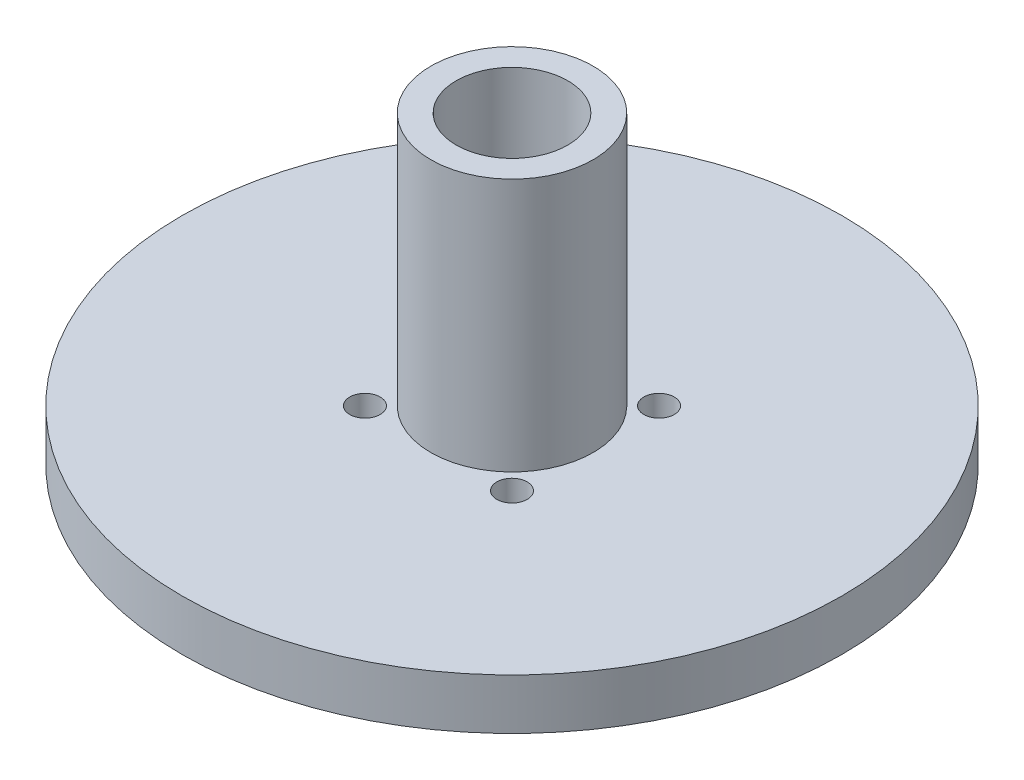
ISO-10303-21;
HEADER;
FILE_DESCRIPTION(('STEP AP214'),'2;1');
FILE_NAME('part.step','',(''),(''),'','','');
FILE_SCHEMA(('AUTOMOTIVE_DESIGN { 1 0 10303 214 1 1 1 1 }'));
ENDSEC;
DATA;
#1=APPLICATION_CONTEXT('core data for automotive mechanical design processes');
#2=APPLICATION_PROTOCOL_DEFINITION('international standard','automotive_design',2000,#1);
#3=PRODUCT_CONTEXT('',#1,'mechanical');
#4=PRODUCT('Part','Part','',(#3));
#5=PRODUCT_RELATED_PRODUCT_CATEGORY('part','',(#4));
#6=PRODUCT_DEFINITION_FORMATION('','',#4);
#7=PRODUCT_DEFINITION_CONTEXT('part definition',#1,'design');
#8=PRODUCT_DEFINITION('design','',#6,#7);
#9=PRODUCT_DEFINITION_SHAPE('','',#8);
#10=(LENGTH_UNIT() NAMED_UNIT(*) SI_UNIT(.MILLI.,.METRE.));
#11=(NAMED_UNIT(*) PLANE_ANGLE_UNIT() SI_UNIT($,.RADIAN.));
#12=(NAMED_UNIT(*) SI_UNIT($,.STERADIAN.) SOLID_ANGLE_UNIT());
#13=UNCERTAINTY_MEASURE_WITH_UNIT(LENGTH_MEASURE(1.E-05),#10,'distance_accuracy_value','');
#14=(GEOMETRIC_REPRESENTATION_CONTEXT(3) GLOBAL_UNCERTAINTY_ASSIGNED_CONTEXT((#13)) GLOBAL_UNIT_ASSIGNED_CONTEXT((#10,
#11,#12)) REPRESENTATION_CONTEXT('',''));
#15=CARTESIAN_POINT('',(0.,0.,0.));
#16=DIRECTION('',(0.,0.,1.));
#17=DIRECTION('',(1.,0.,0.));
#18=AXIS2_PLACEMENT_3D('',#15,#16,#17);
#19=CARTESIAN_POINT('',(0.,5.,0.));
#20=DIRECTION('',(0.,-1.,0.));
#21=DIRECTION('',(0.,0.,-1.));
#22=AXIS2_PLACEMENT_3D('',#19,#20,#21);
#23=CYLINDRICAL_SURFACE('',#22,32.5);
#24=CARTESIAN_POINT('',(0.,5.,0.));
#25=DIRECTION('',(0.,1.,0.));
#26=DIRECTION('',(0.,0.,1.));
#27=AXIS2_PLACEMENT_3D('',#24,#25,#26);
#28=CIRCLE('',#27,32.5);
#29=CARTESIAN_POINT('',(0.,5.,32.5));
#30=VERTEX_POINT('',#29);
#31=EDGE_CURVE('E51',#30,#30,#28,.T.);
#32=ORIENTED_EDGE('',*,*,#31,.F.);
#33=EDGE_LOOP('',(#32));
#34=FACE_BOUND('',#33,.T.);
#35=CARTESIAN_POINT('',(0.,0.,0.));
#36=DIRECTION('',(0.,1.,0.));
#37=DIRECTION('',(0.,0.,1.));
#38=AXIS2_PLACEMENT_3D('',#35,#36,#37);
#39=CIRCLE('',#38,32.5);
#40=CARTESIAN_POINT('',(0.,0.,32.5));
#41=VERTEX_POINT('',#40);
#42=EDGE_CURVE('E46',#41,#41,#39,.T.);
#43=ORIENTED_EDGE('',*,*,#42,.T.);
#44=EDGE_LOOP('',(#43));
#45=FACE_BOUND('',#44,.T.);
#46=ADVANCED_FACE('F43',(#34,#45),#23,.T.);
#47=CARTESIAN_POINT('',(0.,5.,0.));
#48=DIRECTION('',(0.,1.,0.));
#49=DIRECTION('',(0.,0.,1.));
#50=AXIS2_PLACEMENT_3D('',#47,#48,#49);
#51=PLANE('',#50);
#52=CARTESIAN_POINT('',(-7.24784450716205,5.,7.24784450716218));
#53=DIRECTION('',(0.,1.,0.));
#54=DIRECTION('',(0.,0.,1.));
#55=AXIS2_PLACEMENT_3D('',#52,#53,#54);
#56=CIRCLE('',#55,1.50000000000016);
#57=CARTESIAN_POINT('',(-7.24784450716205,5.,8.74784450716234));
#58=VERTEX_POINT('',#57);
#59=EDGE_CURVE('E58',#58,#58,#56,.F.);
#60=ORIENTED_EDGE('',*,*,#59,.T.);
#61=EDGE_LOOP('',(#60));
#62=FACE_BOUND('',#61,.T.);
#63=CARTESIAN_POINT('',(7.24784450716223,5.,7.24784450716209));
#64=DIRECTION('',(0.,1.,0.));
#65=DIRECTION('',(0.,0.,1.));
#66=AXIS2_PLACEMENT_3D('',#63,#64,#65);
#67=CIRCLE('',#66,1.50000000000016);
#68=CARTESIAN_POINT('',(7.24784450716223,5.,8.74784450716225));
#69=VERTEX_POINT('',#68);
#70=EDGE_CURVE('E62',#69,#69,#67,.F.);
#71=ORIENTED_EDGE('',*,*,#70,.T.);
#72=EDGE_LOOP('',(#71));
#73=FACE_BOUND('',#72,.T.);
#74=CARTESIAN_POINT('',(7.24784450716215,5.,-7.24784450716218));
#75=DIRECTION('',(0.,1.,0.));
#76=DIRECTION('',(0.,0.,1.));
#77=AXIS2_PLACEMENT_3D('',#74,#75,#76);
#78=CIRCLE('',#77,1.50000000000007);
#79=CARTESIAN_POINT('',(7.24784450716215,5.,-5.74784450716211));
#80=VERTEX_POINT('',#79);
#81=EDGE_CURVE('E66',#80,#80,#78,.F.);
#82=ORIENTED_EDGE('',*,*,#81,.T.);
#83=EDGE_LOOP('',(#82));
#84=FACE_BOUND('',#83,.T.);
#85=CARTESIAN_POINT('',(-7.24784450716213,5.,-7.2478445071621));
#86=DIRECTION('',(0.,1.,0.));
#87=DIRECTION('',(0.,0.,1.));
#88=AXIS2_PLACEMENT_3D('',#85,#86,#87);
#89=CIRCLE('',#88,1.5);
#90=CARTESIAN_POINT('',(-7.24784450716213,5.,-5.7478445071621));
#91=VERTEX_POINT('',#90);
#92=EDGE_CURVE('E70',#91,#91,#89,.F.);
#93=ORIENTED_EDGE('',*,*,#92,.T.);
#94=EDGE_LOOP('',(#93));
#95=FACE_BOUND('',#94,.T.);
#96=ORIENTED_EDGE('',*,*,#31,.T.);
#97=EDGE_LOOP('',(#96));
#98=FACE_BOUND('',#97,.T.);
#99=CARTESIAN_POINT('',(0.,5.,0.));
#100=DIRECTION('',(0.,1.,0.));
#101=DIRECTION('',(0.,0.,1.));
#102=AXIS2_PLACEMENT_3D('',#99,#100,#101);
#103=CIRCLE('',#102,8.);
#104=CARTESIAN_POINT('',(0.,5.,8.));
#105=VERTEX_POINT('',#104);
#106=EDGE_CURVE('E10',#105,#105,#103,.T.);
#107=ORIENTED_EDGE('',*,*,#106,.F.);
#108=EDGE_LOOP('',(#107));
#109=FACE_BOUND('',#108,.T.);
#110=ADVANCED_FACE('F122',(#62,#73,#84,#95,#98,#109),#51,.T.);
#111=CARTESIAN_POINT('',(0.,0.,0.));
#112=DIRECTION('',(0.,1.,0.));
#113=DIRECTION('',(0.,0.,1.));
#114=AXIS2_PLACEMENT_3D('',#111,#112,#113);
#115=PLANE('',#114);
#116=CARTESIAN_POINT('',(-7.24784450716205,0.,7.24784450716218));
#117=DIRECTION('',(0.,1.,0.));
#118=DIRECTION('',(0.,0.,1.));
#119=AXIS2_PLACEMENT_3D('',#116,#117,#118);
#120=CIRCLE('',#119,1.50000000000016);
#121=CARTESIAN_POINT('',(-7.24784450716205,0.,8.74784450716234));
#122=VERTEX_POINT('',#121);
#123=EDGE_CURVE('E79',#122,#122,#120,.T.);
#124=ORIENTED_EDGE('',*,*,#123,.T.);
#125=EDGE_LOOP('',(#124));
#126=FACE_BOUND('',#125,.T.);
#127=CARTESIAN_POINT('',(7.24784450716223,0.,7.24784450716209));
#128=DIRECTION('',(0.,1.,0.));
#129=DIRECTION('',(0.,0.,1.));
#130=AXIS2_PLACEMENT_3D('',#127,#128,#129);
#131=CIRCLE('',#130,1.50000000000016);
#132=CARTESIAN_POINT('',(7.24784450716223,0.,8.74784450716225));
#133=VERTEX_POINT('',#132);
#134=EDGE_CURVE('E83',#133,#133,#131,.T.);
#135=ORIENTED_EDGE('',*,*,#134,.T.);
#136=EDGE_LOOP('',(#135));
#137=FACE_BOUND('',#136,.T.);
#138=CARTESIAN_POINT('',(7.24784450716215,0.,-7.24784450716218));
#139=DIRECTION('',(0.,1.,0.));
#140=DIRECTION('',(0.,0.,1.));
#141=AXIS2_PLACEMENT_3D('',#138,#139,#140);
#142=CIRCLE('',#141,1.50000000000007);
#143=CARTESIAN_POINT('',(7.24784450716215,0.,-5.74784450716211));
#144=VERTEX_POINT('',#143);
#145=EDGE_CURVE('E78',#144,#144,#142,.T.);
#146=ORIENTED_EDGE('',*,*,#145,.T.);
#147=EDGE_LOOP('',(#146));
#148=FACE_BOUND('',#147,.T.);
#149=CARTESIAN_POINT('',(-7.24784450716213,0.,-7.2478445071621));
#150=DIRECTION('',(0.,1.,0.));
#151=DIRECTION('',(0.,0.,1.));
#152=AXIS2_PLACEMENT_3D('',#149,#150,#151);
#153=CIRCLE('',#152,1.5);
#154=CARTESIAN_POINT('',(-7.24784450716213,0.,-5.7478445071621));
#155=VERTEX_POINT('',#154);
#156=EDGE_CURVE('E74',#155,#155,#153,.T.);
#157=ORIENTED_EDGE('',*,*,#156,.T.);
#158=EDGE_LOOP('',(#157));
#159=FACE_BOUND('',#158,.T.);
#160=ORIENTED_EDGE('',*,*,#42,.F.);
#161=EDGE_LOOP('',(#160));
#162=FACE_BOUND('',#161,.T.);
#163=CARTESIAN_POINT('',(0.,0.,0.));
#164=DIRECTION('',(0.,1.,0.));
#165=DIRECTION('',(0.,0.,1.));
#166=AXIS2_PLACEMENT_3D('',#163,#164,#165);
#167=CIRCLE('',#166,5.5);
#168=CARTESIAN_POINT('',(0.,0.,5.5));
#169=VERTEX_POINT('',#168);
#170=EDGE_CURVE('E95',#169,#169,#167,.T.);
#171=ORIENTED_EDGE('',*,*,#170,.T.);
#172=EDGE_LOOP('',(#171));
#173=FACE_BOUND('',#172,.T.);
#174=ADVANCED_FACE('F127',(#126,#137,#148,#159,#162,#173),#115,.F.);
#175=CARTESIAN_POINT('',(-7.24784450716213,10.,-7.2478445071621));
#176=DIRECTION('',(0.,-1.,0.));
#177=DIRECTION('',(0.,0.,-1.));
#178=AXIS2_PLACEMENT_3D('',#175,#176,#177);
#179=CYLINDRICAL_SURFACE('',#178,1.5);
#180=ORIENTED_EDGE('',*,*,#92,.F.);
#181=EDGE_LOOP('',(#180));
#182=FACE_BOUND('',#181,.T.);
#183=ORIENTED_EDGE('',*,*,#156,.F.);
#184=EDGE_LOOP('',(#183));
#185=FACE_BOUND('',#184,.T.);
#186=ADVANCED_FACE('F138',(#182,#185),#179,.F.);
#187=CARTESIAN_POINT('',(7.24784450716215,10.,-7.24784450716218));
#188=DIRECTION('',(0.,-1.,0.));
#189=DIRECTION('',(0.,0.,-1.));
#190=AXIS2_PLACEMENT_3D('',#187,#188,#189);
#191=CYLINDRICAL_SURFACE('',#190,1.50000000000007);
#192=ORIENTED_EDGE('',*,*,#81,.F.);
#193=EDGE_LOOP('',(#192));
#194=FACE_BOUND('',#193,.T.);
#195=ORIENTED_EDGE('',*,*,#145,.F.);
#196=EDGE_LOOP('',(#195));
#197=FACE_BOUND('',#196,.T.);
#198=ADVANCED_FACE('F178',(#194,#197),#191,.F.);
#199=CARTESIAN_POINT('',(7.24784450716223,10.,7.24784450716209));
#200=DIRECTION('',(0.,-1.,0.));
#201=DIRECTION('',(0.,0.,-1.));
#202=AXIS2_PLACEMENT_3D('',#199,#200,#201);
#203=CYLINDRICAL_SURFACE('',#202,1.50000000000016);
#204=ORIENTED_EDGE('',*,*,#70,.F.);
#205=EDGE_LOOP('',(#204));
#206=FACE_BOUND('',#205,.T.);
#207=ORIENTED_EDGE('',*,*,#134,.F.);
#208=EDGE_LOOP('',(#207));
#209=FACE_BOUND('',#208,.T.);
#210=ADVANCED_FACE('F117',(#206,#209),#203,.F.);
#211=CARTESIAN_POINT('',(-7.24784450716205,10.,7.24784450716218));
#212=DIRECTION('',(0.,-1.,0.));
#213=DIRECTION('',(0.,0.,-1.));
#214=AXIS2_PLACEMENT_3D('',#211,#212,#213);
#215=CYLINDRICAL_SURFACE('',#214,1.50000000000016);
#216=ORIENTED_EDGE('',*,*,#59,.F.);
#217=EDGE_LOOP('',(#216));
#218=FACE_BOUND('',#217,.T.);
#219=ORIENTED_EDGE('',*,*,#123,.F.);
#220=EDGE_LOOP('',(#219));
#221=FACE_BOUND('',#220,.T.);
#222=ADVANCED_FACE('F109',(#218,#221),#215,.F.);
#223=CARTESIAN_POINT('',(0.,30.,0.));
#224=DIRECTION('',(0.,1.,0.));
#225=DIRECTION('',(0.,0.,1.));
#226=AXIS2_PLACEMENT_3D('',#223,#224,#225);
#227=PLANE('',#226);
#228=CARTESIAN_POINT('',(0.,30.,0.));
#229=DIRECTION('',(0.,1.,0.));
#230=DIRECTION('',(0.,0.,1.));
#231=AXIS2_PLACEMENT_3D('',#228,#229,#230);
#232=CIRCLE('',#231,8.);
#233=CARTESIAN_POINT('',(0.,30.,8.));
#234=VERTEX_POINT('',#233);
#235=EDGE_CURVE('E84',#234,#234,#232,.T.);
#236=ORIENTED_EDGE('',*,*,#235,.T.);
#237=EDGE_LOOP('',(#236));
#238=FACE_BOUND('',#237,.T.);
#239=CARTESIAN_POINT('',(0.,30.,0.));
#240=DIRECTION('',(0.,1.,0.));
#241=DIRECTION('',(0.,0.,1.));
#242=AXIS2_PLACEMENT_3D('',#239,#240,#241);
#243=CIRCLE('',#242,5.5);
#244=CARTESIAN_POINT('',(0.,30.,5.5));
#245=VERTEX_POINT('',#244);
#246=EDGE_CURVE('E94',#245,#245,#243,.T.);
#247=ORIENTED_EDGE('',*,*,#246,.F.);
#248=EDGE_LOOP('',(#247));
#249=FACE_BOUND('',#248,.T.);
#250=ADVANCED_FACE('F106',(#238,#249),#227,.T.);
#251=CARTESIAN_POINT('',(0.,30.,0.));
#252=DIRECTION('',(0.,-1.,0.));
#253=DIRECTION('',(0.,0.,-1.));
#254=AXIS2_PLACEMENT_3D('',#251,#252,#253);
#255=CYLINDRICAL_SURFACE('',#254,8.);
#256=ORIENTED_EDGE('',*,*,#106,.T.);
#257=EDGE_LOOP('',(#256));
#258=FACE_BOUND('',#257,.T.);
#259=ORIENTED_EDGE('',*,*,#235,.F.);
#260=EDGE_LOOP('',(#259));
#261=FACE_BOUND('',#260,.T.);
#262=ADVANCED_FACE('F108',(#258,#261),#255,.T.);
#263=CARTESIAN_POINT('',(0.,30.,0.));
#264=DIRECTION('',(0.,-1.,0.));
#265=DIRECTION('',(0.,0.,-1.));
#266=AXIS2_PLACEMENT_3D('',#263,#264,#265);
#267=CYLINDRICAL_SURFACE('',#266,5.5);
#268=ORIENTED_EDGE('',*,*,#246,.T.);
#269=EDGE_LOOP('',(#268));
#270=FACE_BOUND('',#269,.T.);
#271=ORIENTED_EDGE('',*,*,#170,.F.);
#272=EDGE_LOOP('',(#271));
#273=FACE_BOUND('',#272,.T.);
#274=ADVANCED_FACE('F103',(#270,#273),#267,.F.);
#275=CLOSED_SHELL('',(#46,#110,#174,#186,#198,#210,#222,#250,#262,#274));
#276=MANIFOLD_SOLID_BREP('B2',#275);
#277=ADVANCED_BREP_SHAPE_REPRESENTATION('',(#18,#276),#14);
#278=SHAPE_DEFINITION_REPRESENTATION(#9,#277);
ENDSEC;
END-ISO-10303-21;
